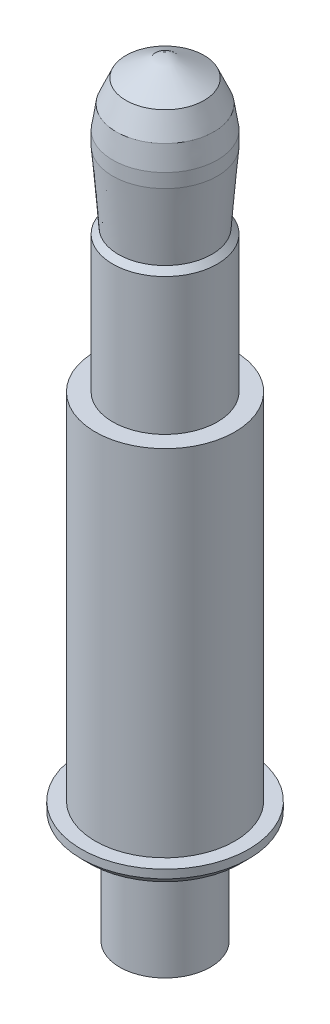
ISO-10303-21;
HEADER;
FILE_DESCRIPTION(('STEP AP214'),'2;1');
FILE_NAME('part.step','',(''),(''),'','','');
FILE_SCHEMA(('AUTOMOTIVE_DESIGN { 1 0 10303 214 1 1 1 1 }'));
ENDSEC;
DATA;
#1=APPLICATION_CONTEXT('core data for automotive mechanical design processes');
#2=APPLICATION_PROTOCOL_DEFINITION('international standard','automotive_design',2000,#1);
#3=PRODUCT_CONTEXT('',#1,'mechanical');
#4=PRODUCT('Part','Part','',(#3));
#5=PRODUCT_RELATED_PRODUCT_CATEGORY('part','',(#4));
#6=PRODUCT_DEFINITION_FORMATION('','',#4);
#7=PRODUCT_DEFINITION_CONTEXT('part definition',#1,'design');
#8=PRODUCT_DEFINITION('design','',#6,#7);
#9=PRODUCT_DEFINITION_SHAPE('','',#8);
#10=(LENGTH_UNIT() NAMED_UNIT(*) SI_UNIT(.MILLI.,.METRE.));
#11=(NAMED_UNIT(*) PLANE_ANGLE_UNIT() SI_UNIT($,.RADIAN.));
#12=(NAMED_UNIT(*) SI_UNIT($,.STERADIAN.) SOLID_ANGLE_UNIT());
#13=UNCERTAINTY_MEASURE_WITH_UNIT(LENGTH_MEASURE(1.E-05),#10,'distance_accuracy_value','');
#14=(GEOMETRIC_REPRESENTATION_CONTEXT(3) GLOBAL_UNCERTAINTY_ASSIGNED_CONTEXT((#13)) GLOBAL_UNIT_ASSIGNED_CONTEXT((#10,
#11,#12)) REPRESENTATION_CONTEXT('',''));
#15=CARTESIAN_POINT('',(0.,0.,0.));
#16=DIRECTION('',(0.,0.,1.));
#17=DIRECTION('',(1.,0.,0.));
#18=AXIS2_PLACEMENT_3D('',#15,#16,#17);
#19=CARTESIAN_POINT('',(0.,5.51999999999997,0.));
#20=DIRECTION('',(0.,-1.,0.));
#21=DIRECTION('',(1.,0.,0.));
#22=AXIS2_PLACEMENT_3D('',#19,#20,#21);
#23=CONICAL_SURFACE('',#22,0.,1.04719755119634);
#24=CARTESIAN_POINT('',(0.,5.35834192462681,0.));
#25=DIRECTION('',(0.,-1.,0.));
#26=DIRECTION('',(1.,0.,0.));
#27=AXIS2_PLACEMENT_3D('',#24,#25,#26);
#28=CIRCLE('',#27,0.279999999999981);
#29=CARTESIAN_POINT('',(0.28,5.35834192462681,0.));
#30=VERTEX_POINT('',#29);
#31=EDGE_CURVE('E142',#30,#30,#28,.T.);
#32=ORIENTED_EDGE('',*,*,#31,.F.);
#33=EDGE_LOOP('',(#32));
#34=FACE_BOUND('',#33,.T.);
#35=CARTESIAN_POINT('',(0.,5.52,0.));
#36=VERTEX_POINT('',#35);
#37=VERTEX_LOOP('',#36);
#38=FACE_BOUND('',#37,.T.);
#39=ADVANCED_FACE('F32',(#34,#38),#23,.T.);
#40=CARTESIAN_POINT('',(0.,5.35834192462681,0.));
#41=DIRECTION('',(0.,-1.,0.));
#42=DIRECTION('',(1.,0.,0.));
#43=AXIS2_PLACEMENT_3D('',#40,#41,#42);
#44=CONICAL_SURFACE('',#43,0.279999999999981,0.412410441597534);
#45=CARTESIAN_POINT('',(0.,5.19834192462687,0.));
#46=DIRECTION('',(0.,-1.,0.));
#47=DIRECTION('',(1.,0.,0.));
#48=AXIS2_PLACEMENT_3D('',#45,#46,#47);
#49=CIRCLE('',#48,0.349999999999982);
#50=CARTESIAN_POINT('',(0.35,5.19834192462687,0.));
#51=VERTEX_POINT('',#50);
#52=EDGE_CURVE('E139',#51,#51,#49,.T.);
#53=ORIENTED_EDGE('',*,*,#52,.F.);
#54=EDGE_LOOP('',(#53));
#55=FACE_BOUND('',#54,.T.);
#56=ORIENTED_EDGE('',*,*,#31,.T.);
#57=EDGE_LOOP('',(#56));
#58=FACE_BOUND('',#57,.T.);
#59=ADVANCED_FACE('F47',(#55,#58),#44,.T.);
#60=CARTESIAN_POINT('',(0.,5.19834192462687,0.));
#61=DIRECTION('',(0.,-1.,0.));
#62=DIRECTION('',(1.,0.,0.));
#63=AXIS2_PLACEMENT_3D('',#60,#61,#62);
#64=CONICAL_SURFACE('',#63,0.349999999999982,0.152649328395205);
#65=CARTESIAN_POINT('',(0.,5.0358419246268,0.));
#66=DIRECTION('',(0.,-1.,0.));
#67=DIRECTION('',(1.,0.,0.));
#68=AXIS2_PLACEMENT_3D('',#65,#66,#67);
#69=CIRCLE('',#68,0.374999999999982);
#70=CARTESIAN_POINT('',(0.375,5.0358419246268,0.));
#71=VERTEX_POINT('',#70);
#72=EDGE_CURVE('E136',#71,#71,#69,.T.);
#73=ORIENTED_EDGE('',*,*,#72,.F.);
#74=EDGE_LOOP('',(#73));
#75=FACE_BOUND('',#74,.T.);
#76=ORIENTED_EDGE('',*,*,#52,.T.);
#77=EDGE_LOOP('',(#76));
#78=FACE_BOUND('',#77,.T.);
#79=ADVANCED_FACE('F52',(#75,#78),#64,.T.);
#80=CARTESIAN_POINT('',(-3.49148133884313E-12,-1000.,0.));
#81=DIRECTION('',(0.,-1.,0.));
#82=DIRECTION('',(1.,0.,0.));
#83=AXIS2_PLACEMENT_3D('',#80,#81,#82);
#84=CYLINDRICAL_SURFACE('',#83,0.374999999999982);
#85=CARTESIAN_POINT('',(0.,4.93584192462682,0.));
#86=DIRECTION('',(0.,-1.,0.));
#87=DIRECTION('',(1.,0.,0.));
#88=AXIS2_PLACEMENT_3D('',#85,#86,#87);
#89=CIRCLE('',#88,0.374999999999982);
#90=CARTESIAN_POINT('',(0.374999999999999,4.93584192462681,0.));
#91=VERTEX_POINT('',#90);
#92=EDGE_CURVE('E133',#91,#91,#89,.T.);
#93=ORIENTED_EDGE('',*,*,#92,.F.);
#94=EDGE_LOOP('',(#93));
#95=FACE_BOUND('',#94,.T.);
#96=ORIENTED_EDGE('',*,*,#72,.T.);
#97=EDGE_LOOP('',(#96));
#98=FACE_BOUND('',#97,.T.);
#99=ADVANCED_FACE('F59',(#95,#98),#84,.T.);
#100=CARTESIAN_POINT('',(0.,4.93584192462682,0.));
#101=DIRECTION('',(0.,1.,0.));
#102=DIRECTION('',(-1.,0.,0.));
#103=AXIS2_PLACEMENT_3D('',#100,#101,#102);
#104=CONICAL_SURFACE('',#103,0.374999999999982,0.0789118809035192);
#105=CARTESIAN_POINT('',(0.,4.42999999999993,0.));
#106=DIRECTION('',(0.,-1.,0.));
#107=DIRECTION('',(1.,0.,0.));
#108=AXIS2_PLACEMENT_3D('',#105,#106,#107);
#109=CIRCLE('',#108,0.334999999999984);
#110=CARTESIAN_POINT('',(0.335,4.42999999999993,0.));
#111=VERTEX_POINT('',#110);
#112=EDGE_CURVE('E130',#111,#111,#109,.T.);
#113=ORIENTED_EDGE('',*,*,#112,.F.);
#114=EDGE_LOOP('',(#113));
#115=FACE_BOUND('',#114,.T.);
#116=ORIENTED_EDGE('',*,*,#92,.T.);
#117=EDGE_LOOP('',(#116));
#118=FACE_BOUND('',#117,.T.);
#119=ADVANCED_FACE('F63',(#115,#118),#104,.T.);
#120=CARTESIAN_POINT('',(0.,4.42999999999993,0.));
#121=DIRECTION('',(0.,-1.,0.));
#122=DIRECTION('',(1.,0.,0.));
#123=AXIS2_PLACEMENT_3D('',#120,#121,#122);
#124=CONICAL_SURFACE('',#123,0.334999999999984,0.785398163396949);
#125=CARTESIAN_POINT('',(0.,4.38999999999989,0.));
#126=DIRECTION('',(0.,-1.,0.));
#127=DIRECTION('',(1.,0.,0.));
#128=AXIS2_PLACEMENT_3D('',#125,#126,#127);
#129=CIRCLE('',#128,0.374999999999984);
#130=CARTESIAN_POINT('',(0.375,4.38999999999989,0.));
#131=VERTEX_POINT('',#130);
#132=EDGE_CURVE('E127',#131,#131,#129,.T.);
#133=ORIENTED_EDGE('',*,*,#132,.F.);
#134=EDGE_LOOP('',(#133));
#135=FACE_BOUND('',#134,.T.);
#136=ORIENTED_EDGE('',*,*,#112,.T.);
#137=EDGE_LOOP('',(#136));
#138=FACE_BOUND('',#137,.T.);
#139=ADVANCED_FACE('F67',(#135,#138),#124,.T.);
#140=CARTESIAN_POINT('',(-3.49148133884313E-12,-1000.,0.));
#141=DIRECTION('',(0.,-1.,0.));
#142=DIRECTION('',(1.,0.,0.));
#143=AXIS2_PLACEMENT_3D('',#140,#141,#142);
#144=CYLINDRICAL_SURFACE('',#143,0.374999999999986);
#145=CARTESIAN_POINT('',(0.,3.40999999999991,0.));
#146=DIRECTION('',(0.,-1.,0.));
#147=DIRECTION('',(1.,0.,0.));
#148=AXIS2_PLACEMENT_3D('',#145,#146,#147);
#149=CIRCLE('',#148,0.374999999999988);
#150=CARTESIAN_POINT('',(0.375,3.40999999999991,0.));
#151=VERTEX_POINT('',#150);
#152=EDGE_CURVE('E124',#151,#151,#149,.T.);
#153=ORIENTED_EDGE('',*,*,#152,.F.);
#154=EDGE_LOOP('',(#153));
#155=FACE_BOUND('',#154,.T.);
#156=ORIENTED_EDGE('',*,*,#132,.T.);
#157=EDGE_LOOP('',(#156));
#158=FACE_BOUND('',#157,.T.);
#159=ADVANCED_FACE('F71',(#155,#158),#144,.T.);
#160=CARTESIAN_POINT('',(0.375,3.41,0.));
#161=DIRECTION('',(0.,-1.,0.));
#162=DIRECTION('',(1.,0.,0.));
#163=AXIS2_PLACEMENT_3D('',#160,#161,#162);
#164=PLANE('',#163);
#165=CARTESIAN_POINT('',(0.,3.40999999999991,0.));
#166=DIRECTION('',(0.,-1.,0.));
#167=DIRECTION('',(1.,0.,0.));
#168=AXIS2_PLACEMENT_3D('',#165,#166,#167);
#169=CIRCLE('',#168,0.499999999999988);
#170=CARTESIAN_POINT('',(0.5,3.40999999999991,0.));
#171=VERTEX_POINT('',#170);
#172=EDGE_CURVE('E121',#171,#171,#169,.T.);
#173=ORIENTED_EDGE('',*,*,#172,.F.);
#174=EDGE_LOOP('',(#173));
#175=FACE_BOUND('',#174,.T.);
#176=ORIENTED_EDGE('',*,*,#152,.T.);
#177=EDGE_LOOP('',(#176));
#178=FACE_BOUND('',#177,.T.);
#179=ADVANCED_FACE('F75',(#175,#178),#164,.F.);
#180=CARTESIAN_POINT('',(-3.49148133884313E-12,-1000.,0.));
#181=DIRECTION('',(0.,-1.,0.));
#182=DIRECTION('',(1.,0.,0.));
#183=AXIS2_PLACEMENT_3D('',#180,#181,#182);
#184=CYLINDRICAL_SURFACE('',#183,0.499999999999965);
#185=CARTESIAN_POINT('',(0.,0.869999999999926,0.));
#186=DIRECTION('',(0.,-1.,0.));
#187=DIRECTION('',(1.,0.,0.));
#188=AXIS2_PLACEMENT_3D('',#185,#186,#187);
#189=CIRCLE('',#188,0.499999999999942);
#190=CARTESIAN_POINT('',(0.499999999999945,0.869999999999925,0.));
#191=VERTEX_POINT('',#190);
#192=EDGE_CURVE('E118',#191,#191,#189,.T.);
#193=ORIENTED_EDGE('',*,*,#192,.F.);
#194=EDGE_LOOP('',(#193));
#195=FACE_BOUND('',#194,.T.);
#196=ORIENTED_EDGE('',*,*,#172,.T.);
#197=EDGE_LOOP('',(#196));
#198=FACE_BOUND('',#197,.T.);
#199=ADVANCED_FACE('F79',(#195,#198),#184,.T.);
#200=CARTESIAN_POINT('',(0.499999999999945,0.869999999997983,0.));
#201=DIRECTION('',(0.,-1.,0.));
#202=DIRECTION('',(1.,0.,0.));
#203=AXIS2_PLACEMENT_3D('',#200,#201,#202);
#204=PLANE('',#203);
#205=CARTESIAN_POINT('',(0.,0.86999999999593,0.));
#206=DIRECTION('',(0.,-1.,0.));
#207=DIRECTION('',(1.,0.,0.));
#208=AXIS2_PLACEMENT_3D('',#205,#206,#207);
#209=CIRCLE('',#208,0.599999999995745);
#210=CARTESIAN_POINT('',(0.599999999995748,0.869999999995927,0.));
#211=VERTEX_POINT('',#210);
#212=EDGE_CURVE('E113',#211,#211,#209,.T.);
#213=ORIENTED_EDGE('',*,*,#212,.F.);
#214=EDGE_LOOP('',(#213));
#215=FACE_BOUND('',#214,.T.);
#216=ORIENTED_EDGE('',*,*,#192,.T.);
#217=EDGE_LOOP('',(#216));
#218=FACE_BOUND('',#217,.T.);
#219=ADVANCED_FACE('F83',(#215,#218),#204,.F.);
#220=CARTESIAN_POINT('',(-3.49148133884313E-12,-1000.,0.));
#221=DIRECTION('',(0.,-1.,0.));
#222=DIRECTION('',(1.,0.,0.));
#223=AXIS2_PLACEMENT_3D('',#220,#221,#222);
#224=CYLINDRICAL_SURFACE('',#223,0.599999999995745);
#225=CARTESIAN_POINT('',(0.,0.810000000005306,0.));
#226=DIRECTION('',(0.,1.,0.));
#227=DIRECTION('',(-1.,0.,0.));
#228=AXIS2_PLACEMENT_3D('',#225,#226,#227);
#229=CIRCLE('',#228,0.599999999995745);
#230=CARTESIAN_POINT('',(-0.599999999995742,0.810000000005309,0.));
#231=VERTEX_POINT('',#230);
#232=EDGE_CURVE('E11',#231,#231,#229,.T.);
#233=ORIENTED_EDGE('',*,*,#232,.T.);
#234=EDGE_LOOP('',(#233));
#235=FACE_BOUND('',#234,.T.);
#236=ORIENTED_EDGE('',*,*,#212,.T.);
#237=EDGE_LOOP('',(#236));
#238=FACE_BOUND('',#237,.T.);
#239=ADVANCED_FACE('F87',(#235,#238),#224,.T.);
#240=CARTESIAN_POINT('',(0.325000000001842,0.750000000005344,0.));
#241=DIRECTION('',(0.,1.,0.));
#242=DIRECTION('',(-1.,0.,0.));
#243=AXIS2_PLACEMENT_3D('',#240,#241,#242);
#244=PLANE('',#243);
#245=CARTESIAN_POINT('',(0.,0.750000000005345,0.));
#246=DIRECTION('',(0.,1.,0.));
#247=DIRECTION('',(-1.,0.,0.));
#248=AXIS2_PLACEMENT_3D('',#245,#246,#247);
#249=CIRCLE('',#248,0.539999999995735);
#250=CARTESIAN_POINT('',(-0.539999999995732,0.750000000005347,0.));
#251=VERTEX_POINT('',#250);
#252=EDGE_CURVE('E40',#251,#251,#249,.F.);
#253=ORIENTED_EDGE('',*,*,#252,.T.);
#254=EDGE_LOOP('',(#253));
#255=FACE_BOUND('',#254,.T.);
#256=CARTESIAN_POINT('',(0.,0.750000000005357,0.));
#257=DIRECTION('',(0.,-1.,0.));
#258=DIRECTION('',(1.,0.,0.));
#259=AXIS2_PLACEMENT_3D('',#256,#257,#258);
#260=CIRCLE('',#259,0.325000000001839);
#261=CARTESIAN_POINT('',(0.325000000001842,0.750000000005356,0.));
#262=VERTEX_POINT('',#261);
#263=EDGE_CURVE('E110',#262,#262,#260,.T.);
#264=ORIENTED_EDGE('',*,*,#263,.F.);
#265=EDGE_LOOP('',(#264));
#266=FACE_BOUND('',#265,.T.);
#267=ADVANCED_FACE('F91',(#255,#266),#244,.F.);
#268=CARTESIAN_POINT('',(-3.49148133884313E-12,-1000.,0.));
#269=DIRECTION('',(0.,-1.,0.));
#270=DIRECTION('',(1.,0.,0.));
#271=AXIS2_PLACEMENT_3D('',#268,#269,#270);
#272=CYLINDRICAL_SURFACE('',#271,0.32500000000184);
#273=CARTESIAN_POINT('',(0.,0.,0.));
#274=DIRECTION('',(0.,-1.,0.));
#275=DIRECTION('',(1.,0.,0.));
#276=AXIS2_PLACEMENT_3D('',#273,#274,#275);
#277=CIRCLE('',#276,0.325000000001842);
#278=CARTESIAN_POINT('',(0.325000000001842,0.,0.));
#279=VERTEX_POINT('',#278);
#280=EDGE_CURVE('E109',#279,#279,#277,.T.);
#281=ORIENTED_EDGE('',*,*,#280,.F.);
#282=EDGE_LOOP('',(#281));
#283=FACE_BOUND('',#282,.T.);
#284=ORIENTED_EDGE('',*,*,#263,.T.);
#285=EDGE_LOOP('',(#284));
#286=FACE_BOUND('',#285,.T.);
#287=ADVANCED_FACE('F95',(#283,#286),#272,.T.);
#288=CARTESIAN_POINT('',(0.,0.,0.));
#289=DIRECTION('',(0.,1.,0.));
#290=DIRECTION('',(-1.,0.,0.));
#291=AXIS2_PLACEMENT_3D('',#288,#289,#290);
#292=CONICAL_SURFACE('',#291,0.325000000001842,1.50320713008664);
#293=CARTESIAN_POINT('',(0.,-0.0220000000006494,0.));
#294=VERTEX_POINT('',#293);
#295=VERTEX_LOOP('',#294);
#296=FACE_BOUND('',#295,.T.);
#297=ORIENTED_EDGE('',*,*,#280,.T.);
#298=EDGE_LOOP('',(#297));
#299=FACE_BOUND('',#298,.T.);
#300=ADVANCED_FACE('F99',(#296,#299),#292,.T.);
#301=CARTESIAN_POINT('',(0.,0.750000000005357,0.));
#302=DIRECTION('',(0.,1.,0.));
#303=DIRECTION('',(-1.,0.,0.));
#304=AXIS2_PLACEMENT_3D('',#301,#302,#303);
#305=CONICAL_SURFACE('',#304,0.539999999995748,0.785398163397852);
#306=ORIENTED_EDGE('',*,*,#232,.F.);
#307=EDGE_LOOP('',(#306));
#308=FACE_BOUND('',#307,.T.);
#309=ORIENTED_EDGE('',*,*,#252,.F.);
#310=EDGE_LOOP('',(#309));
#311=FACE_BOUND('',#310,.T.);
#312=ADVANCED_FACE('F34',(#308,#311),#305,.T.);
#313=CLOSED_SHELL('',(#39,#59,#79,#99,#119,#139,#159,#179,#199,#219,#239,#267,#287,#300,#312));
#314=MANIFOLD_SOLID_BREP('B2',#313);
#315=ADVANCED_BREP_SHAPE_REPRESENTATION('',(#18,#314),#14);
#316=SHAPE_DEFINITION_REPRESENTATION(#9,#315);
ENDSEC;
END-ISO-10303-21;
